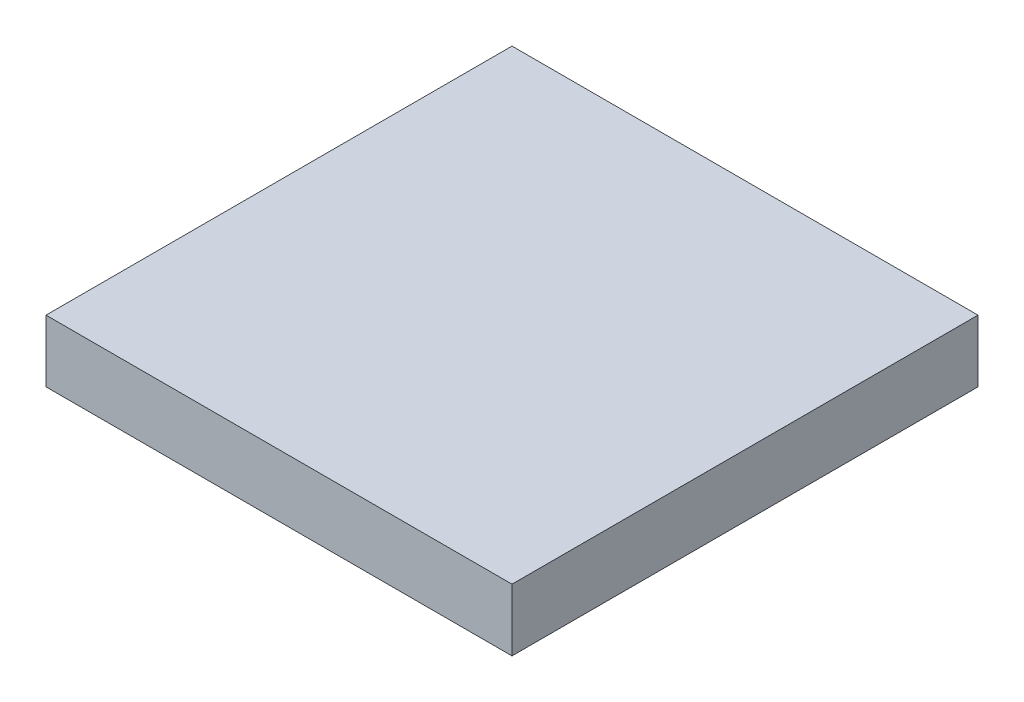
ISO-10303-21;
HEADER;
FILE_DESCRIPTION(('STEP AP214'),'2;1');
FILE_NAME('part.step','',(''),(''),'','','');
FILE_SCHEMA(('AUTOMOTIVE_DESIGN { 1 0 10303 214 1 1 1 1 }'));
ENDSEC;
DATA;
#1=APPLICATION_CONTEXT('core data for automotive mechanical design processes');
#2=APPLICATION_PROTOCOL_DEFINITION('international standard','automotive_design',2000,#1);
#3=PRODUCT_CONTEXT('',#1,'mechanical');
#4=PRODUCT('Part','Part','',(#3));
#5=PRODUCT_RELATED_PRODUCT_CATEGORY('part','',(#4));
#6=PRODUCT_DEFINITION_FORMATION('','',#4);
#7=PRODUCT_DEFINITION_CONTEXT('part definition',#1,'design');
#8=PRODUCT_DEFINITION('design','',#6,#7);
#9=PRODUCT_DEFINITION_SHAPE('','',#8);
#10=(LENGTH_UNIT() NAMED_UNIT(*) SI_UNIT(.MILLI.,.METRE.));
#11=(NAMED_UNIT(*) PLANE_ANGLE_UNIT() SI_UNIT($,.RADIAN.));
#12=(NAMED_UNIT(*) SI_UNIT($,.STERADIAN.) SOLID_ANGLE_UNIT());
#13=UNCERTAINTY_MEASURE_WITH_UNIT(LENGTH_MEASURE(1.E-05),#10,'distance_accuracy_value','');
#14=(GEOMETRIC_REPRESENTATION_CONTEXT(3) GLOBAL_UNCERTAINTY_ASSIGNED_CONTEXT((#13)) GLOBAL_UNIT_ASSIGNED_CONTEXT((#10,
#11,#12)) REPRESENTATION_CONTEXT('',''));
#15=CARTESIAN_POINT('',(0.,0.,0.));
#16=DIRECTION('',(0.,0.,1.));
#17=DIRECTION('',(1.,0.,0.));
#18=AXIS2_PLACEMENT_3D('',#15,#16,#17);
#19=CARTESIAN_POINT('',(-7.5,2.,7.5));
#20=DIRECTION('',(1.,0.,0.));
#21=DIRECTION('',(0.,0.,-1.));
#22=AXIS2_PLACEMENT_3D('',#19,#20,#21);
#23=PLANE('',#22);
#24=DIRECTION('',(0.,0.,1.));
#25=VECTOR('',#24,1.);
#26=CARTESIAN_POINT('',(-7.5,0.,7.5));
#27=LINE('',#26,#25);
#28=CARTESIAN_POINT('',(-7.5,0.,-7.5));
#29=VERTEX_POINT('',#28);
#30=CARTESIAN_POINT('',(-7.5,0.,7.5));
#31=VERTEX_POINT('',#30);
#32=EDGE_CURVE('E96',#29,#31,#27,.T.);
#33=ORIENTED_EDGE('',*,*,#32,.T.);
#34=DIRECTION('',(0.,-1.,0.));
#35=VECTOR('',#34,1.);
#36=CARTESIAN_POINT('',(-7.5,2.,7.5));
#37=LINE('',#36,#35);
#38=CARTESIAN_POINT('',(-7.5,2.,7.5));
#39=VERTEX_POINT('',#38);
#40=EDGE_CURVE('E11',#39,#31,#37,.T.);
#41=ORIENTED_EDGE('',*,*,#40,.F.);
#42=DIRECTION('',(0.,0.,1.));
#43=VECTOR('',#42,1.);
#44=CARTESIAN_POINT('',(-7.5,2.,7.5));
#45=LINE('',#44,#43);
#46=CARTESIAN_POINT('',(-7.5,2.,-7.5));
#47=VERTEX_POINT('',#46);
#48=EDGE_CURVE('E84',#47,#39,#45,.T.);
#49=ORIENTED_EDGE('',*,*,#48,.F.);
#50=DIRECTION('',(0.,-1.,0.));
#51=VECTOR('',#50,1.);
#52=CARTESIAN_POINT('',(-7.5,2.,-7.5));
#53=LINE('',#52,#51);
#54=EDGE_CURVE('E92',#47,#29,#53,.T.);
#55=ORIENTED_EDGE('',*,*,#54,.T.);
#56=EDGE_LOOP('',(#33,#41,#49,#55));
#57=FACE_BOUND('',#56,.T.);
#58=ADVANCED_FACE('F33',(#57),#23,.F.);
#59=CARTESIAN_POINT('',(7.5,2.,7.5));
#60=DIRECTION('',(0.,0.,-1.));
#61=DIRECTION('',(-1.,0.,0.));
#62=AXIS2_PLACEMENT_3D('',#59,#60,#61);
#63=PLANE('',#62);
#64=DIRECTION('',(1.,0.,0.));
#65=VECTOR('',#64,1.);
#66=CARTESIAN_POINT('',(7.5,0.,7.5));
#67=LINE('',#66,#65);
#68=CARTESIAN_POINT('',(7.5,0.,7.5));
#69=VERTEX_POINT('',#68);
#70=EDGE_CURVE('E88',#31,#69,#67,.T.);
#71=ORIENTED_EDGE('',*,*,#70,.T.);
#72=DIRECTION('',(0.,-1.,0.));
#73=VECTOR('',#72,1.);
#74=CARTESIAN_POINT('',(7.5,2.,7.5));
#75=LINE('',#74,#73);
#76=CARTESIAN_POINT('',(7.5,2.,7.5));
#77=VERTEX_POINT('',#76);
#78=EDGE_CURVE('E41',#77,#69,#75,.T.);
#79=ORIENTED_EDGE('',*,*,#78,.F.);
#80=DIRECTION('',(1.,0.,0.));
#81=VECTOR('',#80,1.);
#82=CARTESIAN_POINT('',(7.5,2.,7.5));
#83=LINE('',#82,#81);
#84=EDGE_CURVE('E79',#39,#77,#83,.T.);
#85=ORIENTED_EDGE('',*,*,#84,.F.);
#86=ORIENTED_EDGE('',*,*,#40,.T.);
#87=EDGE_LOOP('',(#71,#79,#85,#86));
#88=FACE_BOUND('',#87,.T.);
#89=ADVANCED_FACE('F87',(#88),#63,.F.);
#90=CARTESIAN_POINT('',(7.5,2.,7.5));
#91=DIRECTION('',(-1.,0.,0.));
#92=DIRECTION('',(0.,0.,1.));
#93=AXIS2_PLACEMENT_3D('',#90,#91,#92);
#94=PLANE('',#93);
#95=DIRECTION('',(0.,0.,-1.));
#96=VECTOR('',#95,1.);
#97=CARTESIAN_POINT('',(7.5,0.,7.5));
#98=LINE('',#97,#96);
#99=CARTESIAN_POINT('',(7.5,0.,-7.5));
#100=VERTEX_POINT('',#99);
#101=EDGE_CURVE('E66',#69,#100,#98,.T.);
#102=ORIENTED_EDGE('',*,*,#101,.T.);
#103=DIRECTION('',(0.,-1.,0.));
#104=VECTOR('',#103,1.);
#105=CARTESIAN_POINT('',(7.5,2.,-7.5));
#106=LINE('',#105,#104);
#107=CARTESIAN_POINT('',(7.5,2.,-7.5));
#108=VERTEX_POINT('',#107);
#109=EDGE_CURVE('E89',#108,#100,#106,.T.);
#110=ORIENTED_EDGE('',*,*,#109,.F.);
#111=DIRECTION('',(0.,0.,-1.));
#112=VECTOR('',#111,1.);
#113=CARTESIAN_POINT('',(7.5,2.,7.5));
#114=LINE('',#113,#112);
#115=EDGE_CURVE('E82',#77,#108,#114,.T.);
#116=ORIENTED_EDGE('',*,*,#115,.F.);
#117=ORIENTED_EDGE('',*,*,#78,.T.);
#118=EDGE_LOOP('',(#102,#110,#116,#117));
#119=FACE_BOUND('',#118,.T.);
#120=ADVANCED_FACE('F90',(#119),#94,.F.);
#121=CARTESIAN_POINT('',(7.5,2.,-7.5));
#122=DIRECTION('',(0.,0.,1.));
#123=DIRECTION('',(1.,0.,0.));
#124=AXIS2_PLACEMENT_3D('',#121,#122,#123);
#125=PLANE('',#124);
#126=DIRECTION('',(-1.,0.,0.));
#127=VECTOR('',#126,1.);
#128=CARTESIAN_POINT('',(7.5,0.,-7.5));
#129=LINE('',#128,#127);
#130=EDGE_CURVE('E72',#100,#29,#129,.T.);
#131=ORIENTED_EDGE('',*,*,#130,.T.);
#132=ORIENTED_EDGE('',*,*,#54,.F.);
#133=DIRECTION('',(-1.,0.,0.));
#134=VECTOR('',#133,1.);
#135=CARTESIAN_POINT('',(7.5,2.,-7.5));
#136=LINE('',#135,#134);
#137=EDGE_CURVE('E49',#108,#47,#136,.T.);
#138=ORIENTED_EDGE('',*,*,#137,.F.);
#139=ORIENTED_EDGE('',*,*,#109,.T.);
#140=EDGE_LOOP('',(#131,#132,#138,#139));
#141=FACE_BOUND('',#140,.T.);
#142=ADVANCED_FACE('F103',(#141),#125,.F.);
#143=CARTESIAN_POINT('',(0.,2.,0.));
#144=DIRECTION('',(0.,1.,0.));
#145=DIRECTION('',(0.,0.,1.));
#146=AXIS2_PLACEMENT_3D('',#143,#144,#145);
#147=PLANE('',#146);
#148=ORIENTED_EDGE('',*,*,#48,.T.);
#149=ORIENTED_EDGE('',*,*,#84,.T.);
#150=ORIENTED_EDGE('',*,*,#115,.T.);
#151=ORIENTED_EDGE('',*,*,#137,.T.);
#152=EDGE_LOOP('',(#148,#149,#150,#151));
#153=FACE_BOUND('',#152,.T.);
#154=ADVANCED_FACE('F80',(#153),#147,.T.);
#155=CARTESIAN_POINT('',(0.,0.,0.));
#156=DIRECTION('',(0.,1.,0.));
#157=DIRECTION('',(0.,0.,1.));
#158=AXIS2_PLACEMENT_3D('',#155,#156,#157);
#159=PLANE('',#158);
#160=ORIENTED_EDGE('',*,*,#32,.F.);
#161=ORIENTED_EDGE('',*,*,#130,.F.);
#162=ORIENTED_EDGE('',*,*,#101,.F.);
#163=ORIENTED_EDGE('',*,*,#70,.F.);
#164=EDGE_LOOP('',(#160,#161,#162,#163));
#165=FACE_BOUND('',#164,.T.);
#166=ADVANCED_FACE('F106',(#165),#159,.F.);
#167=CLOSED_SHELL('',(#58,#89,#120,#142,#154,#166));
#168=MANIFOLD_SOLID_BREP('B2',#167);
#169=ADVANCED_BREP_SHAPE_REPRESENTATION('',(#18,#168),#14);
#170=SHAPE_DEFINITION_REPRESENTATION(#9,#169);
ENDSEC;
END-ISO-10303-21;
